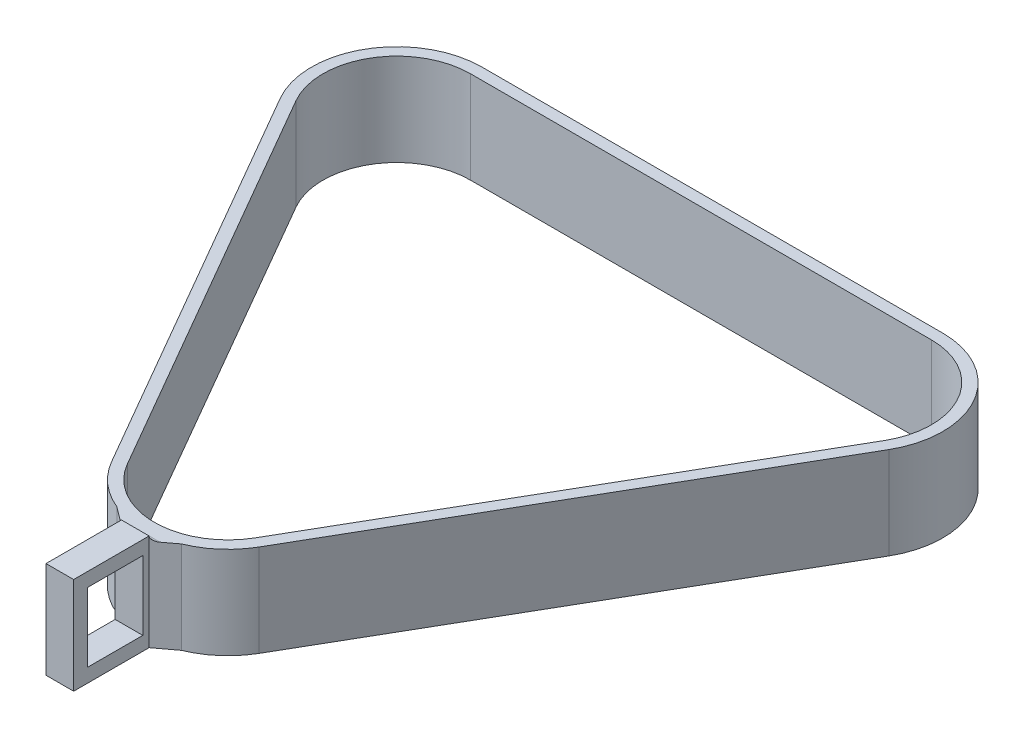
ISO-10303-21;
HEADER;
FILE_DESCRIPTION(('STEP AP214'),'2;1');
FILE_NAME('part.step','',(''),(''),'','','');
FILE_SCHEMA(('AUTOMOTIVE_DESIGN { 1 0 10303 214 1 1 1 1 }'));
ENDSEC;
DATA;
#1=APPLICATION_CONTEXT('core data for automotive mechanical design processes');
#2=APPLICATION_PROTOCOL_DEFINITION('international standard','automotive_design',2000,#1);
#3=PRODUCT_CONTEXT('',#1,'mechanical');
#4=PRODUCT('Part','Part','',(#3));
#5=PRODUCT_RELATED_PRODUCT_CATEGORY('part','',(#4));
#6=PRODUCT_DEFINITION_FORMATION('','',#4);
#7=PRODUCT_DEFINITION_CONTEXT('part definition',#1,'design');
#8=PRODUCT_DEFINITION('design','',#6,#7);
#9=PRODUCT_DEFINITION_SHAPE('','',#8);
#10=(LENGTH_UNIT() NAMED_UNIT(*) SI_UNIT(.MILLI.,.METRE.));
#11=(NAMED_UNIT(*) PLANE_ANGLE_UNIT() SI_UNIT($,.RADIAN.));
#12=(NAMED_UNIT(*) SI_UNIT($,.STERADIAN.) SOLID_ANGLE_UNIT());
#13=UNCERTAINTY_MEASURE_WITH_UNIT(LENGTH_MEASURE(1.E-05),#10,'distance_accuracy_value','');
#14=(GEOMETRIC_REPRESENTATION_CONTEXT(3) GLOBAL_UNCERTAINTY_ASSIGNED_CONTEXT((#13)) GLOBAL_UNIT_ASSIGNED_CONTEXT((#10,
#11,#12)) REPRESENTATION_CONTEXT('',''));
#15=CARTESIAN_POINT('',(0.,0.,0.));
#16=DIRECTION('',(0.,0.,1.));
#17=DIRECTION('',(1.,0.,0.));
#18=AXIS2_PLACEMENT_3D('',#15,#16,#17);
#19=CARTESIAN_POINT('',(70.3090004006341,0.,93.745333867512));
#20=DIRECTION('',(-0.600000000000001,0.,-0.799999999999999));
#21=DIRECTION('',(-0.799999999999999,0.,0.600000000000001));
#22=AXIS2_PLACEMENT_3D('',#19,#20,#21);
#23=PLANE('',#22);
#24=DIRECTION('',(0.799999999999999,0.,-0.600000000000001));
#25=VECTOR('',#24,1.);
#26=CARTESIAN_POINT('',(70.3090004006341,20.,93.745333867512));
#27=LINE('',#26,#25);
#28=CARTESIAN_POINT('',(54.3333333333333,20.,105.727084167988));
#29=VERTEX_POINT('',#28);
#30=CARTESIAN_POINT('',(57.,20.,103.727084167988));
#31=VERTEX_POINT('',#30);
#32=EDGE_CURVE('E383',#29,#31,#27,.T.);
#33=ORIENTED_EDGE('',*,*,#32,.F.);
#34=CARTESIAN_POINT('',(54.3333333333333,21.,105.727084167988));
#35=DIRECTION('',(-0.600000000000001,0.,-0.799999999999999));
#36=DIRECTION('',(-0.799999999999999,0.,0.600000000000001));
#37=AXIS2_PLACEMENT_3D('',#34,#35,#36);
#38=ELLIPSE('',#37,1.66666666666666,1.);
#39=CARTESIAN_POINT('',(53.,21.,106.727084167988));
#40=VERTEX_POINT('',#39);
#41=EDGE_CURVE('E56',#29,#40,#38,.T.);
#42=ORIENTED_EDGE('',*,*,#41,.T.);
#43=DIRECTION('',(0.,1.,0.));
#44=VECTOR('',#43,1.);
#45=CARTESIAN_POINT('',(53.,0.,106.727084167988));
#46=LINE('',#45,#44);
#47=CARTESIAN_POINT('',(53.,0.,106.727084167988));
#48=VERTEX_POINT('',#47);
#49=EDGE_CURVE('E63',#48,#40,#46,.T.);
#50=ORIENTED_EDGE('',*,*,#49,.F.);
#51=DIRECTION('',(-0.799999999999999,0.,0.600000000000001));
#52=VECTOR('',#51,1.);
#53=CARTESIAN_POINT('',(70.3090004006341,0.,93.745333867512));
#54=LINE('',#53,#52);
#55=CARTESIAN_POINT('',(57.,0.,103.727084167988));
#56=VERTEX_POINT('',#55);
#57=EDGE_CURVE('E336',#56,#48,#54,.T.);
#58=ORIENTED_EDGE('',*,*,#57,.F.);
#59=DIRECTION('',(0.,1.,0.));
#60=VECTOR('',#59,1.);
#61=CARTESIAN_POINT('',(57.,0.,103.727084167988));
#62=LINE('',#61,#60);
#63=EDGE_CURVE('E330',#56,#31,#62,.T.);
#64=ORIENTED_EDGE('',*,*,#63,.T.);
#65=EDGE_LOOP('',(#33,#42,#50,#58,#64));
#66=FACE_BOUND('',#65,.T.);
#67=ADVANCED_FACE('F47',(#66),#23,.F.);
#68=CARTESIAN_POINT('',(-34.309000400634,0.,45.7453338675119));
#69=DIRECTION('',(0.600000000000001,0.,-0.799999999999999));
#70=DIRECTION('',(-0.799999999999999,0.,-0.600000000000001));
#71=AXIS2_PLACEMENT_3D('',#68,#69,#70);
#72=PLANE('',#71);
#73=DIRECTION('',(0.799999999999999,0.,0.600000000000001));
#74=VECTOR('',#73,1.);
#75=CARTESIAN_POINT('',(-34.309000400634,20.,45.7453338675119));
#76=LINE('',#75,#74);
#77=CARTESIAN_POINT('',(43.,20.,103.727084167988));
#78=VERTEX_POINT('',#77);
#79=CARTESIAN_POINT('',(45.6666666666667,20.,105.727084167988));
#80=VERTEX_POINT('',#79);
#81=EDGE_CURVE('E198',#78,#80,#76,.T.);
#82=ORIENTED_EDGE('',*,*,#81,.F.);
#83=DIRECTION('',(0.,1.,0.));
#84=VECTOR('',#83,1.);
#85=CARTESIAN_POINT('',(43.,0.,103.727084167988));
#86=LINE('',#85,#84);
#87=CARTESIAN_POINT('',(43.,0.,103.727084167988));
#88=VERTEX_POINT('',#87);
#89=EDGE_CURVE('E210',#88,#78,#86,.T.);
#90=ORIENTED_EDGE('',*,*,#89,.F.);
#91=DIRECTION('',(-0.799999999999999,0.,-0.600000000000001));
#92=VECTOR('',#91,1.);
#93=CARTESIAN_POINT('',(-34.309000400634,0.,45.7453338675119));
#94=LINE('',#93,#92);
#95=CARTESIAN_POINT('',(47.,0.,106.727084167988));
#96=VERTEX_POINT('',#95);
#97=EDGE_CURVE('E206',#96,#88,#94,.T.);
#98=ORIENTED_EDGE('',*,*,#97,.F.);
#99=DIRECTION('',(0.,1.,0.));
#100=VECTOR('',#99,1.);
#101=CARTESIAN_POINT('',(47.,0.,106.727084167988));
#102=LINE('',#101,#100);
#103=CARTESIAN_POINT('',(47.,21.,106.727084167988));
#104=VERTEX_POINT('',#103);
#105=EDGE_CURVE('E202',#96,#104,#102,.T.);
#106=ORIENTED_EDGE('',*,*,#105,.T.);
#107=CARTESIAN_POINT('',(45.6666666666667,21.,105.727084167988));
#108=DIRECTION('',(0.600000000000001,0.,-0.799999999999999));
#109=DIRECTION('',(-0.799999999999999,0.,-0.600000000000001));
#110=AXIS2_PLACEMENT_3D('',#107,#108,#109);
#111=ELLIPSE('',#110,1.66666666666666,1.);
#112=EDGE_CURVE('E11',#104,#80,#111,.T.);
#113=ORIENTED_EDGE('',*,*,#112,.T.);
#114=EDGE_LOOP('',(#82,#90,#98,#106,#113));
#115=FACE_BOUND('',#114,.T.);
#116=ADVANCED_FACE('F204',(#115),#72,.F.);
#117=CARTESIAN_POINT('',(0.,21.,0.));
#118=DIRECTION('',(0.,1.,0.));
#119=DIRECTION('',(0.,0.,1.));
#120=AXIS2_PLACEMENT_3D('',#117,#118,#119);
#121=PLANE('',#120);
#122=DIRECTION('',(0.,0.,-1.));
#123=VECTOR('',#122,1.);
#124=CARTESIAN_POINT('',(53.,21.,105.102540378444));
#125=LINE('',#124,#123);
#126=CARTESIAN_POINT('',(53.,21.,123.102540378444));
#127=VERTEX_POINT('',#126);
#128=EDGE_CURVE('E218',#127,#40,#125,.T.);
#129=ORIENTED_EDGE('',*,*,#128,.T.);
#130=DIRECTION('',(1.,0.,0.));
#131=VECTOR('',#130,1.);
#132=CARTESIAN_POINT('',(20.,21.,106.727084167988));
#133=LINE('',#132,#131);
#134=EDGE_CURVE('E215',#104,#40,#133,.T.);
#135=ORIENTED_EDGE('',*,*,#134,.F.);
#136=DIRECTION('',(0.,0.,-1.));
#137=VECTOR('',#136,1.);
#138=CARTESIAN_POINT('',(47.,21.,105.102540378444));
#139=LINE('',#138,#137);
#140=CARTESIAN_POINT('',(47.,21.,123.102540378444));
#141=VERTEX_POINT('',#140);
#142=EDGE_CURVE('E217',#141,#104,#139,.T.);
#143=ORIENTED_EDGE('',*,*,#142,.F.);
#144=DIRECTION('',(-1.,0.,0.));
#145=VECTOR('',#144,1.);
#146=CARTESIAN_POINT('',(53.,21.,123.102540378444));
#147=LINE('',#146,#145);
#148=EDGE_CURVE('E338',#127,#141,#147,.T.);
#149=ORIENTED_EDGE('',*,*,#148,.F.);
#150=EDGE_LOOP('',(#129,#135,#143,#149));
#151=FACE_BOUND('',#150,.T.);
#152=ADVANCED_FACE('F216',(#151),#121,.T.);
#153=CARTESIAN_POINT('',(50.,20.,86.6025403784439));
#154=DIRECTION('',(0.,-1.,0.));
#155=DIRECTION('',(0.,0.,-1.));
#156=AXIS2_PLACEMENT_3D('',#153,#154,#155);
#157=CYLINDRICAL_SURFACE('',#156,18.5);
#158=ORIENTED_EDGE('',*,*,#89,.T.);
#159=CARTESIAN_POINT('',(50.,20.,86.6025403784439));
#160=DIRECTION('',(0.,1.,0.));
#161=DIRECTION('',(0.,0.,1.));
#162=AXIS2_PLACEMENT_3D('',#159,#160,#161);
#163=CIRCLE('',#162,18.5);
#164=CARTESIAN_POINT('',(33.9785300299879,20.,95.8525403784439));
#165=VERTEX_POINT('',#164);
#166=EDGE_CURVE('E316',#165,#78,#163,.T.);
#167=ORIENTED_EDGE('',*,*,#166,.F.);
#168=DIRECTION('',(0.,-1.,0.));
#169=VECTOR('',#168,1.);
#170=CARTESIAN_POINT('',(33.9785300299879,20.,95.8525403784439));
#171=LINE('',#170,#169);
#172=CARTESIAN_POINT('',(33.9785300299879,0.,95.8525403784439));
#173=VERTEX_POINT('',#172);
#174=EDGE_CURVE('E251',#165,#173,#171,.T.);
#175=ORIENTED_EDGE('',*,*,#174,.T.);
#176=CARTESIAN_POINT('',(50.,0.,86.6025403784439));
#177=DIRECTION('',(0.,1.,0.));
#178=DIRECTION('',(0.,0.,1.));
#179=AXIS2_PLACEMENT_3D('',#176,#177,#178);
#180=CIRCLE('',#179,18.5);
#181=EDGE_CURVE('E285',#173,#88,#180,.T.);
#182=ORIENTED_EDGE('',*,*,#181,.T.);
#183=EDGE_LOOP('',(#158,#167,#175,#182));
#184=FACE_BOUND('',#183,.T.);
#185=ADVANCED_FACE('F390',(#184),#157,.T.);
#186=ORIENTED_EDGE('',*,*,#63,.F.);
#187=CARTESIAN_POINT('',(66.0214699700121,0.,95.8525403784439));
#188=VERTEX_POINT('',#187);
#189=EDGE_CURVE('E288',#56,#188,#180,.T.);
#190=ORIENTED_EDGE('',*,*,#189,.T.);
#191=DIRECTION('',(0.,-1.,0.));
#192=VECTOR('',#191,1.);
#193=CARTESIAN_POINT('',(66.0214699700121,20.,95.8525403784439));
#194=LINE('',#193,#192);
#195=CARTESIAN_POINT('',(66.0214699700121,20.,95.8525403784439));
#196=VERTEX_POINT('',#195);
#197=EDGE_CURVE('E254',#196,#188,#194,.T.);
#198=ORIENTED_EDGE('',*,*,#197,.F.);
#199=EDGE_CURVE('E319',#31,#196,#163,.T.);
#200=ORIENTED_EDGE('',*,*,#199,.F.);
#201=EDGE_LOOP('',(#186,#190,#198,#200));
#202=FACE_BOUND('',#201,.T.);
#203=ADVANCED_FACE('F428',(#202),#157,.T.);
#204=CARTESIAN_POINT('',(0.,20.,0.));
#205=DIRECTION('',(0.,1.,0.));
#206=DIRECTION('',(0.,0.,1.));
#207=AXIS2_PLACEMENT_3D('',#204,#205,#206);
#208=PLANE('',#207);
#209=CARTESIAN_POINT('',(100.,20.,0.));
#210=DIRECTION('',(0.,1.,0.));
#211=DIRECTION('',(0.,0.,1.));
#212=AXIS2_PLACEMENT_3D('',#209,#210,#211);
#213=CIRCLE('',#212,16.);
#214=CARTESIAN_POINT('',(113.856406460551,20.,8.));
#215=VERTEX_POINT('',#214);
#216=CARTESIAN_POINT('',(100.,20.,-16.));
#217=VERTEX_POINT('',#216);
#218=EDGE_CURVE('E313',#215,#217,#213,.T.);
#219=ORIENTED_EDGE('',*,*,#218,.F.);
#220=DIRECTION('',(-0.5,0.,0.866025403784439));
#221=VECTOR('',#220,1.);
#222=CARTESIAN_POINT('',(88.856406460551,20.,51.3012701892219));
#223=LINE('',#222,#221);
#224=CARTESIAN_POINT('',(63.856406460551,20.,94.6025403784439));
#225=VERTEX_POINT('',#224);
#226=EDGE_CURVE('E311',#215,#225,#223,.T.);
#227=ORIENTED_EDGE('',*,*,#226,.T.);
#228=CARTESIAN_POINT('',(50.,20.,86.6025403784439));
#229=DIRECTION('',(0.,1.,0.));
#230=DIRECTION('',(0.,0.,1.));
#231=AXIS2_PLACEMENT_3D('',#228,#229,#230);
#232=CIRCLE('',#231,16.);
#233=CARTESIAN_POINT('',(36.143593539449,20.,94.6025403784439));
#234=VERTEX_POINT('',#233);
#235=EDGE_CURVE('E308',#234,#225,#232,.T.);
#236=ORIENTED_EDGE('',*,*,#235,.F.);
#237=DIRECTION('',(0.5,0.,0.866025403784439));
#238=VECTOR('',#237,1.);
#239=CARTESIAN_POINT('',(-13.856406460551,20.,8.));
#240=LINE('',#239,#238);
#241=CARTESIAN_POINT('',(-13.856406460551,20.,8.));
#242=VERTEX_POINT('',#241);
#243=EDGE_CURVE('E305',#242,#234,#240,.T.);
#244=ORIENTED_EDGE('',*,*,#243,.F.);
#245=CARTESIAN_POINT('',(0.,20.,0.));
#246=DIRECTION('',(0.,1.,0.));
#247=DIRECTION('',(0.,0.,1.));
#248=AXIS2_PLACEMENT_3D('',#245,#246,#247);
#249=CIRCLE('',#248,16.);
#250=CARTESIAN_POINT('',(0.,20.,-16.));
#251=VERTEX_POINT('',#250);
#252=EDGE_CURVE('E302',#251,#242,#249,.T.);
#253=ORIENTED_EDGE('',*,*,#252,.F.);
#254=DIRECTION('',(-1.,0.,0.));
#255=VECTOR('',#254,1.);
#256=CARTESIAN_POINT('',(0.,20.,-16.));
#257=LINE('',#256,#255);
#258=EDGE_CURVE('E256',#217,#251,#257,.T.);
#259=ORIENTED_EDGE('',*,*,#258,.F.);
#260=EDGE_LOOP('',(#219,#227,#236,#244,#253,#259));
#261=FACE_BOUND('',#260,.T.);
#262=ORIENTED_EDGE('',*,*,#81,.T.);
#263=DIRECTION('',(1.,0.,0.));
#264=VECTOR('',#263,1.);
#265=CARTESIAN_POINT('',(53.,20.,105.727084167988));
#266=LINE('',#265,#264);
#267=EDGE_CURVE('E230',#80,#29,#266,.T.);
#268=ORIENTED_EDGE('',*,*,#267,.T.);
#269=ORIENTED_EDGE('',*,*,#32,.T.);
#270=ORIENTED_EDGE('',*,*,#199,.T.);
#271=DIRECTION('',(0.5,0.,-0.866025403784439));
#272=VECTOR('',#271,1.);
#273=CARTESIAN_POINT('',(91.0214699700121,20.,52.5512701892219));
#274=LINE('',#273,#272);
#275=CARTESIAN_POINT('',(116.021469970012,20.,9.25000000000001));
#276=VERTEX_POINT('',#275);
#277=EDGE_CURVE('E269',#196,#276,#274,.T.);
#278=ORIENTED_EDGE('',*,*,#277,.T.);
#279=CARTESIAN_POINT('',(100.,20.,0.));
#280=DIRECTION('',(0.,1.,0.));
#281=DIRECTION('',(0.,0.,1.));
#282=AXIS2_PLACEMENT_3D('',#279,#280,#281);
#283=CIRCLE('',#282,18.5);
#284=CARTESIAN_POINT('',(100.,20.,-18.5));
#285=VERTEX_POINT('',#284);
#286=EDGE_CURVE('E326',#276,#285,#283,.T.);
#287=ORIENTED_EDGE('',*,*,#286,.T.);
#288=DIRECTION('',(-1.,0.,0.));
#289=VECTOR('',#288,1.);
#290=CARTESIAN_POINT('',(0.,20.,-18.5));
#291=LINE('',#290,#289);
#292=CARTESIAN_POINT('',(0.,20.,-18.5));
#293=VERTEX_POINT('',#292);
#294=EDGE_CURVE('E324',#285,#293,#291,.T.);
#295=ORIENTED_EDGE('',*,*,#294,.T.);
#296=CARTESIAN_POINT('',(0.,20.,0.));
#297=DIRECTION('',(0.,1.,0.));
#298=DIRECTION('',(0.,0.,1.));
#299=AXIS2_PLACEMENT_3D('',#296,#297,#298);
#300=CIRCLE('',#299,18.5);
#301=CARTESIAN_POINT('',(-16.0214699700121,20.,9.25));
#302=VERTEX_POINT('',#301);
#303=EDGE_CURVE('E322',#293,#302,#300,.T.);
#304=ORIENTED_EDGE('',*,*,#303,.T.);
#305=DIRECTION('',(0.5,0.,0.866025403784439));
#306=VECTOR('',#305,1.);
#307=CARTESIAN_POINT('',(-16.0214699700121,20.,9.25));
#308=LINE('',#307,#306);
#309=EDGE_CURVE('E320',#302,#165,#308,.T.);
#310=ORIENTED_EDGE('',*,*,#309,.T.);
#311=ORIENTED_EDGE('',*,*,#166,.T.);
#312=EDGE_LOOP('',(#262,#268,#269,#270,#278,#287,#295,#304,#310,#311));
#313=FACE_BOUND('',#312,.T.);
#314=ADVANCED_FACE('F385',(#261,#313),#208,.T.);
#315=CARTESIAN_POINT('',(100.,20.,0.));
#316=DIRECTION('',(0.,-1.,0.));
#317=DIRECTION('',(0.,0.,-1.));
#318=AXIS2_PLACEMENT_3D('',#315,#316,#317);
#319=CYLINDRICAL_SURFACE('',#318,16.);
#320=CARTESIAN_POINT('',(100.,0.,0.));
#321=DIRECTION('',(0.,1.,0.));
#322=DIRECTION('',(0.,0.,1.));
#323=AXIS2_PLACEMENT_3D('',#320,#321,#322);
#324=CIRCLE('',#323,16.);
#325=CARTESIAN_POINT('',(113.856406460551,0.,8.));
#326=VERTEX_POINT('',#325);
#327=CARTESIAN_POINT('',(100.,0.,-16.));
#328=VERTEX_POINT('',#327);
#329=EDGE_CURVE('E282',#326,#328,#324,.T.);
#330=ORIENTED_EDGE('',*,*,#329,.F.);
#331=DIRECTION('',(0.,-1.,0.));
#332=VECTOR('',#331,1.);
#333=CARTESIAN_POINT('',(113.856406460551,20.,8.));
#334=LINE('',#333,#332);
#335=EDGE_CURVE('E233',#215,#326,#334,.T.);
#336=ORIENTED_EDGE('',*,*,#335,.F.);
#337=ORIENTED_EDGE('',*,*,#218,.T.);
#338=DIRECTION('',(0.,-1.,0.));
#339=VECTOR('',#338,1.);
#340=CARTESIAN_POINT('',(100.,20.,-16.));
#341=LINE('',#340,#339);
#342=EDGE_CURVE('E241',#217,#328,#341,.T.);
#343=ORIENTED_EDGE('',*,*,#342,.T.);
#344=EDGE_LOOP('',(#330,#336,#337,#343));
#345=FACE_BOUND('',#344,.T.);
#346=ADVANCED_FACE('F427',(#345),#319,.F.);
#347=CARTESIAN_POINT('',(88.856406460551,20.,51.3012701892219));
#348=DIRECTION('',(0.866025403784439,0.,0.5));
#349=DIRECTION('',(0.5,0.,-0.866025403784439));
#350=AXIS2_PLACEMENT_3D('',#347,#348,#349);
#351=PLANE('',#350);
#352=DIRECTION('',(-0.5,0.,0.866025403784439));
#353=VECTOR('',#352,1.);
#354=CARTESIAN_POINT('',(88.856406460551,0.,51.3012701892219));
#355=LINE('',#354,#353);
#356=CARTESIAN_POINT('',(63.856406460551,0.,94.6025403784439));
#357=VERTEX_POINT('',#356);
#358=EDGE_CURVE('E279',#326,#357,#355,.T.);
#359=ORIENTED_EDGE('',*,*,#358,.T.);
#360=DIRECTION('',(0.,-1.,0.));
#361=VECTOR('',#360,1.);
#362=CARTESIAN_POINT('',(63.856406460551,20.,94.6025403784439));
#363=LINE('',#362,#361);
#364=EDGE_CURVE('E235',#225,#357,#363,.T.);
#365=ORIENTED_EDGE('',*,*,#364,.F.);
#366=ORIENTED_EDGE('',*,*,#226,.F.);
#367=ORIENTED_EDGE('',*,*,#335,.T.);
#368=EDGE_LOOP('',(#359,#365,#366,#367));
#369=FACE_BOUND('',#368,.T.);
#370=ADVANCED_FACE('F447',(#369),#351,.F.);
#371=CARTESIAN_POINT('',(50.,20.,86.6025403784439));
#372=DIRECTION('',(0.,-1.,0.));
#373=DIRECTION('',(0.,0.,-1.));
#374=AXIS2_PLACEMENT_3D('',#371,#372,#373);
#375=CYLINDRICAL_SURFACE('',#374,16.);
#376=CARTESIAN_POINT('',(50.,0.,86.6025403784439));
#377=DIRECTION('',(0.,1.,0.));
#378=DIRECTION('',(0.,0.,1.));
#379=AXIS2_PLACEMENT_3D('',#376,#377,#378);
#380=CIRCLE('',#379,16.);
#381=CARTESIAN_POINT('',(36.143593539449,0.,94.6025403784439));
#382=VERTEX_POINT('',#381);
#383=EDGE_CURVE('E276',#382,#357,#380,.T.);
#384=ORIENTED_EDGE('',*,*,#383,.F.);
#385=DIRECTION('',(0.,-1.,0.));
#386=VECTOR('',#385,1.);
#387=CARTESIAN_POINT('',(36.143593539449,20.,94.6025403784439));
#388=LINE('',#387,#386);
#389=EDGE_CURVE('E259',#234,#382,#388,.T.);
#390=ORIENTED_EDGE('',*,*,#389,.F.);
#391=ORIENTED_EDGE('',*,*,#235,.T.);
#392=ORIENTED_EDGE('',*,*,#364,.T.);
#393=EDGE_LOOP('',(#384,#390,#391,#392));
#394=FACE_BOUND('',#393,.T.);
#395=ADVANCED_FACE('F443',(#394),#375,.F.);
#396=CARTESIAN_POINT('',(-13.856406460551,20.,8.));
#397=DIRECTION('',(0.866025403784439,0.,-0.5));
#398=DIRECTION('',(-0.5,0.,-0.866025403784439));
#399=AXIS2_PLACEMENT_3D('',#396,#397,#398);
#400=PLANE('',#399);
#401=DIRECTION('',(0.5,0.,0.866025403784439));
#402=VECTOR('',#401,1.);
#403=CARTESIAN_POINT('',(-13.856406460551,0.,8.));
#404=LINE('',#403,#402);
#405=CARTESIAN_POINT('',(-13.856406460551,0.,8.));
#406=VERTEX_POINT('',#405);
#407=EDGE_CURVE('E273',#406,#382,#404,.T.);
#408=ORIENTED_EDGE('',*,*,#407,.F.);
#409=DIRECTION('',(0.,-1.,0.));
#410=VECTOR('',#409,1.);
#411=CARTESIAN_POINT('',(-13.856406460551,20.,8.));
#412=LINE('',#411,#410);
#413=EDGE_CURVE('E261',#242,#406,#412,.T.);
#414=ORIENTED_EDGE('',*,*,#413,.F.);
#415=ORIENTED_EDGE('',*,*,#243,.T.);
#416=ORIENTED_EDGE('',*,*,#389,.T.);
#417=EDGE_LOOP('',(#408,#414,#415,#416));
#418=FACE_BOUND('',#417,.T.);
#419=ADVANCED_FACE('F439',(#418),#400,.T.);
#420=CARTESIAN_POINT('',(0.,20.,0.));
#421=DIRECTION('',(0.,-1.,0.));
#422=DIRECTION('',(0.,0.,-1.));
#423=AXIS2_PLACEMENT_3D('',#420,#421,#422);
#424=CYLINDRICAL_SURFACE('',#423,16.);
#425=CARTESIAN_POINT('',(0.,0.,0.));
#426=DIRECTION('',(0.,1.,0.));
#427=DIRECTION('',(0.,0.,1.));
#428=AXIS2_PLACEMENT_3D('',#425,#426,#427);
#429=CIRCLE('',#428,16.);
#430=CARTESIAN_POINT('',(0.,0.,-16.));
#431=VERTEX_POINT('',#430);
#432=EDGE_CURVE('E270',#431,#406,#429,.T.);
#433=ORIENTED_EDGE('',*,*,#432,.F.);
#434=DIRECTION('',(0.,-1.,0.));
#435=VECTOR('',#434,1.);
#436=CARTESIAN_POINT('',(0.,20.,-16.));
#437=LINE('',#436,#435);
#438=EDGE_CURVE('E263',#251,#431,#437,.T.);
#439=ORIENTED_EDGE('',*,*,#438,.F.);
#440=ORIENTED_EDGE('',*,*,#252,.T.);
#441=ORIENTED_EDGE('',*,*,#413,.T.);
#442=EDGE_LOOP('',(#433,#439,#440,#441));
#443=FACE_BOUND('',#442,.T.);
#444=ADVANCED_FACE('F435',(#443),#424,.F.);
#445=CARTESIAN_POINT('',(91.0214699700121,20.,52.5512701892219));
#446=DIRECTION('',(-0.866025403784439,0.,-0.5));
#447=DIRECTION('',(-0.5,0.,0.866025403784439));
#448=AXIS2_PLACEMENT_3D('',#445,#446,#447);
#449=PLANE('',#448);
#450=DIRECTION('',(0.5,0.,-0.866025403784439));
#451=VECTOR('',#450,1.);
#452=CARTESIAN_POINT('',(91.0214699700121,0.,52.5512701892219));
#453=LINE('',#452,#451);
#454=CARTESIAN_POINT('',(116.021469970012,0.,9.25000000000001));
#455=VERTEX_POINT('',#454);
#456=EDGE_CURVE('E297',#188,#455,#453,.T.);
#457=ORIENTED_EDGE('',*,*,#456,.T.);
#458=DIRECTION('',(0.,-1.,0.));
#459=VECTOR('',#458,1.);
#460=CARTESIAN_POINT('',(116.021469970012,20.,9.25000000000001));
#461=LINE('',#460,#459);
#462=EDGE_CURVE('E238',#276,#455,#461,.T.);
#463=ORIENTED_EDGE('',*,*,#462,.F.);
#464=ORIENTED_EDGE('',*,*,#277,.F.);
#465=ORIENTED_EDGE('',*,*,#197,.T.);
#466=EDGE_LOOP('',(#457,#463,#464,#465));
#467=FACE_BOUND('',#466,.T.);
#468=ADVANCED_FACE('F438',(#467),#449,.F.);
#469=CARTESIAN_POINT('',(100.,20.,0.));
#470=DIRECTION('',(0.,-1.,0.));
#471=DIRECTION('',(0.,0.,-1.));
#472=AXIS2_PLACEMENT_3D('',#469,#470,#471);
#473=CYLINDRICAL_SURFACE('',#472,18.5);
#474=CARTESIAN_POINT('',(100.,0.,0.));
#475=DIRECTION('',(0.,1.,0.));
#476=DIRECTION('',(0.,0.,1.));
#477=AXIS2_PLACEMENT_3D('',#474,#475,#476);
#478=CIRCLE('',#477,18.5);
#479=CARTESIAN_POINT('',(100.,0.,-18.5));
#480=VERTEX_POINT('',#479);
#481=EDGE_CURVE('E295',#455,#480,#478,.T.);
#482=ORIENTED_EDGE('',*,*,#481,.T.);
#483=DIRECTION('',(0.,-1.,0.));
#484=VECTOR('',#483,1.);
#485=CARTESIAN_POINT('',(100.,20.,-18.5));
#486=LINE('',#485,#484);
#487=EDGE_CURVE('E242',#285,#480,#486,.T.);
#488=ORIENTED_EDGE('',*,*,#487,.F.);
#489=ORIENTED_EDGE('',*,*,#286,.F.);
#490=ORIENTED_EDGE('',*,*,#462,.T.);
#491=EDGE_LOOP('',(#482,#488,#489,#490));
#492=FACE_BOUND('',#491,.T.);
#493=ADVANCED_FACE('F467',(#492),#473,.T.);
#494=CARTESIAN_POINT('',(0.,20.,-18.5));
#495=DIRECTION('',(0.,0.,1.));
#496=DIRECTION('',(1.,0.,0.));
#497=AXIS2_PLACEMENT_3D('',#494,#495,#496);
#498=PLANE('',#497);
#499=DIRECTION('',(-1.,0.,0.));
#500=VECTOR('',#499,1.);
#501=CARTESIAN_POINT('',(0.,0.,-18.5));
#502=LINE('',#501,#500);
#503=CARTESIAN_POINT('',(0.,0.,-18.5));
#504=VERTEX_POINT('',#503);
#505=EDGE_CURVE('E293',#480,#504,#502,.T.);
#506=ORIENTED_EDGE('',*,*,#505,.T.);
#507=DIRECTION('',(0.,-1.,0.));
#508=VECTOR('',#507,1.);
#509=CARTESIAN_POINT('',(0.,20.,-18.5));
#510=LINE('',#509,#508);
#511=EDGE_CURVE('E245',#293,#504,#510,.T.);
#512=ORIENTED_EDGE('',*,*,#511,.F.);
#513=ORIENTED_EDGE('',*,*,#294,.F.);
#514=ORIENTED_EDGE('',*,*,#487,.T.);
#515=EDGE_LOOP('',(#506,#512,#513,#514));
#516=FACE_BOUND('',#515,.T.);
#517=ADVANCED_FACE('F463',(#516),#498,.F.);
#518=CARTESIAN_POINT('',(0.,20.,0.));
#519=DIRECTION('',(0.,-1.,0.));
#520=DIRECTION('',(0.,0.,-1.));
#521=AXIS2_PLACEMENT_3D('',#518,#519,#520);
#522=CYLINDRICAL_SURFACE('',#521,18.5);
#523=CARTESIAN_POINT('',(0.,0.,0.));
#524=DIRECTION('',(0.,1.,0.));
#525=DIRECTION('',(0.,0.,1.));
#526=AXIS2_PLACEMENT_3D('',#523,#524,#525);
#527=CIRCLE('',#526,18.5);
#528=CARTESIAN_POINT('',(-16.0214699700121,0.,9.25));
#529=VERTEX_POINT('',#528);
#530=EDGE_CURVE('E291',#504,#529,#527,.T.);
#531=ORIENTED_EDGE('',*,*,#530,.T.);
#532=DIRECTION('',(0.,-1.,0.));
#533=VECTOR('',#532,1.);
#534=CARTESIAN_POINT('',(-16.0214699700121,20.,9.25));
#535=LINE('',#534,#533);
#536=EDGE_CURVE('E248',#302,#529,#535,.T.);
#537=ORIENTED_EDGE('',*,*,#536,.F.);
#538=ORIENTED_EDGE('',*,*,#303,.F.);
#539=ORIENTED_EDGE('',*,*,#511,.T.);
#540=EDGE_LOOP('',(#531,#537,#538,#539));
#541=FACE_BOUND('',#540,.T.);
#542=ADVANCED_FACE('F459',(#541),#522,.T.);
#543=CARTESIAN_POINT('',(-16.0214699700121,20.,9.25));
#544=DIRECTION('',(0.866025403784439,0.,-0.5));
#545=DIRECTION('',(-0.5,0.,-0.866025403784439));
#546=AXIS2_PLACEMENT_3D('',#543,#544,#545);
#547=PLANE('',#546);
#548=DIRECTION('',(0.5,0.,0.866025403784439));
#549=VECTOR('',#548,1.);
#550=CARTESIAN_POINT('',(-16.0214699700121,0.,9.25));
#551=LINE('',#550,#549);
#552=EDGE_CURVE('E289',#529,#173,#551,.T.);
#553=ORIENTED_EDGE('',*,*,#552,.T.);
#554=ORIENTED_EDGE('',*,*,#174,.F.);
#555=ORIENTED_EDGE('',*,*,#309,.F.);
#556=ORIENTED_EDGE('',*,*,#536,.T.);
#557=EDGE_LOOP('',(#553,#554,#555,#556));
#558=FACE_BOUND('',#557,.T.);
#559=ADVANCED_FACE('F433',(#558),#547,.F.);
#560=CARTESIAN_POINT('',(0.,20.,-16.));
#561=DIRECTION('',(0.,0.,1.));
#562=DIRECTION('',(1.,0.,0.));
#563=AXIS2_PLACEMENT_3D('',#560,#561,#562);
#564=PLANE('',#563);
#565=DIRECTION('',(-1.,0.,0.));
#566=VECTOR('',#565,1.);
#567=CARTESIAN_POINT('',(0.,0.,-16.));
#568=LINE('',#567,#566);
#569=EDGE_CURVE('E266',#328,#431,#568,.T.);
#570=ORIENTED_EDGE('',*,*,#569,.F.);
#571=ORIENTED_EDGE('',*,*,#342,.F.);
#572=ORIENTED_EDGE('',*,*,#258,.T.);
#573=ORIENTED_EDGE('',*,*,#438,.T.);
#574=EDGE_LOOP('',(#570,#571,#572,#573));
#575=FACE_BOUND('',#574,.T.);
#576=ADVANCED_FACE('F413',(#575),#564,.T.);
#577=CARTESIAN_POINT('',(0.,0.,0.));
#578=DIRECTION('',(0.,1.,0.));
#579=DIRECTION('',(0.,0.,1.));
#580=AXIS2_PLACEMENT_3D('',#577,#578,#579);
#581=PLANE('',#580);
#582=ORIENTED_EDGE('',*,*,#189,.F.);
#583=ORIENTED_EDGE('',*,*,#57,.T.);
#584=DIRECTION('',(0.,0.,1.));
#585=VECTOR('',#584,1.);
#586=CARTESIAN_POINT('',(53.,0.,105.102540378444));
#587=LINE('',#586,#585);
#588=CARTESIAN_POINT('',(53.,0.,123.102540378444));
#589=VERTEX_POINT('',#588);
#590=EDGE_CURVE('E347',#48,#589,#587,.T.);
#591=ORIENTED_EDGE('',*,*,#590,.T.);
#592=DIRECTION('',(-1.,0.,0.));
#593=VECTOR('',#592,1.);
#594=CARTESIAN_POINT('',(53.,0.,123.102540378444));
#595=LINE('',#594,#593);
#596=CARTESIAN_POINT('',(47.,0.,123.102540378444));
#597=VERTEX_POINT('',#596);
#598=EDGE_CURVE('E339',#589,#597,#595,.T.);
#599=ORIENTED_EDGE('',*,*,#598,.T.);
#600=DIRECTION('',(0.,0.,1.));
#601=VECTOR('',#600,1.);
#602=CARTESIAN_POINT('',(47.,0.,105.102540378444));
#603=LINE('',#602,#601);
#604=EDGE_CURVE('E369',#96,#597,#603,.T.);
#605=ORIENTED_EDGE('',*,*,#604,.F.);
#606=ORIENTED_EDGE('',*,*,#97,.T.);
#607=ORIENTED_EDGE('',*,*,#181,.F.);
#608=ORIENTED_EDGE('',*,*,#552,.F.);
#609=ORIENTED_EDGE('',*,*,#530,.F.);
#610=ORIENTED_EDGE('',*,*,#505,.F.);
#611=ORIENTED_EDGE('',*,*,#481,.F.);
#612=ORIENTED_EDGE('',*,*,#456,.F.);
#613=EDGE_LOOP('',(#582,#583,#591,#599,#605,#606,#607,#608,#609,#610,#611,#612));
#614=FACE_BOUND('',#613,.T.);
#615=ORIENTED_EDGE('',*,*,#329,.T.);
#616=ORIENTED_EDGE('',*,*,#569,.T.);
#617=ORIENTED_EDGE('',*,*,#432,.T.);
#618=ORIENTED_EDGE('',*,*,#407,.T.);
#619=ORIENTED_EDGE('',*,*,#383,.T.);
#620=ORIENTED_EDGE('',*,*,#358,.F.);
#621=EDGE_LOOP('',(#615,#616,#617,#618,#619,#620));
#622=FACE_BOUND('',#621,.T.);
#623=ADVANCED_FACE('F395',(#614,#622),#581,.F.);
#624=CARTESIAN_POINT('',(53.,0.,0.));
#625=DIRECTION('',(1.,0.,0.));
#626=DIRECTION('',(0.,0.,-1.));
#627=AXIS2_PLACEMENT_3D('',#624,#625,#626);
#628=PLANE('',#627);
#629=DIRECTION('',(0.,-1.,0.));
#630=VECTOR('',#629,1.);
#631=CARTESIAN_POINT('',(53.,3.,108.102540378444));
#632=LINE('',#631,#630);
#633=CARTESIAN_POINT('',(53.,18.,108.102540378444));
#634=VERTEX_POINT('',#633);
#635=CARTESIAN_POINT('',(53.,3.,108.102540378444));
#636=VERTEX_POINT('',#635);
#637=EDGE_CURVE('E226',#634,#636,#632,.T.);
#638=ORIENTED_EDGE('',*,*,#637,.T.);
#639=DIRECTION('',(0.,0.,1.));
#640=VECTOR('',#639,1.);
#641=CARTESIAN_POINT('',(53.,3.,108.102540378444));
#642=LINE('',#641,#640);
#643=CARTESIAN_POINT('',(53.,3.,120.102540378444));
#644=VERTEX_POINT('',#643);
#645=EDGE_CURVE('E363',#636,#644,#642,.T.);
#646=ORIENTED_EDGE('',*,*,#645,.T.);
#647=DIRECTION('',(0.,1.,0.));
#648=VECTOR('',#647,1.);
#649=CARTESIAN_POINT('',(53.,3.,120.102540378444));
#650=LINE('',#649,#648);
#651=CARTESIAN_POINT('',(53.,18.,120.102540378444));
#652=VERTEX_POINT('',#651);
#653=EDGE_CURVE('E360',#644,#652,#650,.T.);
#654=ORIENTED_EDGE('',*,*,#653,.T.);
#655=DIRECTION('',(0.,0.,-1.));
#656=VECTOR('',#655,1.);
#657=CARTESIAN_POINT('',(53.,18.,108.102540378444));
#658=LINE('',#657,#656);
#659=EDGE_CURVE('E353',#652,#634,#658,.T.);
#660=ORIENTED_EDGE('',*,*,#659,.T.);
#661=EDGE_LOOP('',(#638,#646,#654,#660));
#662=FACE_BOUND('',#661,.T.);
#663=ORIENTED_EDGE('',*,*,#49,.T.);
#664=ORIENTED_EDGE('',*,*,#128,.F.);
#665=DIRECTION('',(0.,1.,0.));
#666=VECTOR('',#665,1.);
#667=CARTESIAN_POINT('',(53.,0.,123.102540378444));
#668=LINE('',#667,#666);
#669=EDGE_CURVE('E344',#589,#127,#668,.T.);
#670=ORIENTED_EDGE('',*,*,#669,.F.);
#671=ORIENTED_EDGE('',*,*,#590,.F.);
#672=EDGE_LOOP('',(#663,#664,#670,#671));
#673=FACE_BOUND('',#672,.T.);
#674=ADVANCED_FACE('F402',(#662,#673),#628,.T.);
#675=CARTESIAN_POINT('',(47.,0.,0.));
#676=DIRECTION('',(1.,0.,0.));
#677=DIRECTION('',(0.,0.,-1.));
#678=AXIS2_PLACEMENT_3D('',#675,#676,#677);
#679=PLANE('',#678);
#680=DIRECTION('',(0.,-1.,0.));
#681=VECTOR('',#680,1.);
#682=CARTESIAN_POINT('',(47.,3.,108.102540378444));
#683=LINE('',#682,#681);
#684=CARTESIAN_POINT('',(47.,18.,108.102540378444));
#685=VERTEX_POINT('',#684);
#686=CARTESIAN_POINT('',(47.,3.,108.102540378444));
#687=VERTEX_POINT('',#686);
#688=EDGE_CURVE('E380',#685,#687,#683,.T.);
#689=ORIENTED_EDGE('',*,*,#688,.F.);
#690=DIRECTION('',(0.,0.,-1.));
#691=VECTOR('',#690,1.);
#692=CARTESIAN_POINT('',(47.,18.,108.102540378444));
#693=LINE('',#692,#691);
#694=CARTESIAN_POINT('',(47.,18.,120.102540378444));
#695=VERTEX_POINT('',#694);
#696=EDGE_CURVE('E371',#695,#685,#693,.T.);
#697=ORIENTED_EDGE('',*,*,#696,.F.);
#698=DIRECTION('',(0.,1.,0.));
#699=VECTOR('',#698,1.);
#700=CARTESIAN_POINT('',(47.,3.,120.102540378444));
#701=LINE('',#700,#699);
#702=CARTESIAN_POINT('',(47.,3.,120.102540378444));
#703=VERTEX_POINT('',#702);
#704=EDGE_CURVE('E374',#703,#695,#701,.T.);
#705=ORIENTED_EDGE('',*,*,#704,.F.);
#706=DIRECTION('',(0.,0.,1.));
#707=VECTOR('',#706,1.);
#708=CARTESIAN_POINT('',(47.,3.,108.102540378444));
#709=LINE('',#708,#707);
#710=EDGE_CURVE('E377',#687,#703,#709,.T.);
#711=ORIENTED_EDGE('',*,*,#710,.F.);
#712=EDGE_LOOP('',(#689,#697,#705,#711));
#713=FACE_BOUND('',#712,.T.);
#714=ORIENTED_EDGE('',*,*,#142,.T.);
#715=ORIENTED_EDGE('',*,*,#105,.F.);
#716=ORIENTED_EDGE('',*,*,#604,.T.);
#717=DIRECTION('',(0.,1.,0.));
#718=VECTOR('',#717,1.);
#719=CARTESIAN_POINT('',(47.,0.,123.102540378444));
#720=LINE('',#719,#718);
#721=EDGE_CURVE('E225',#597,#141,#720,.T.);
#722=ORIENTED_EDGE('',*,*,#721,.T.);
#723=EDGE_LOOP('',(#714,#715,#716,#722));
#724=FACE_BOUND('',#723,.T.);
#725=ADVANCED_FACE('F223',(#713,#724),#679,.F.);
#726=CARTESIAN_POINT('',(53.,0.,123.102540378444));
#727=DIRECTION('',(0.,0.,1.));
#728=DIRECTION('',(1.,0.,0.));
#729=AXIS2_PLACEMENT_3D('',#726,#727,#728);
#730=PLANE('',#729);
#731=ORIENTED_EDGE('',*,*,#148,.T.);
#732=ORIENTED_EDGE('',*,*,#721,.F.);
#733=ORIENTED_EDGE('',*,*,#598,.F.);
#734=ORIENTED_EDGE('',*,*,#669,.T.);
#735=EDGE_LOOP('',(#731,#732,#733,#734));
#736=FACE_BOUND('',#735,.T.);
#737=ADVANCED_FACE('F401',(#736),#730,.T.);
#738=CARTESIAN_POINT('',(53.,3.,108.102540378444));
#739=DIRECTION('',(0.,0.,-1.));
#740=DIRECTION('',(-1.,0.,0.));
#741=AXIS2_PLACEMENT_3D('',#738,#739,#740);
#742=PLANE('',#741);
#743=DIRECTION('',(-1.,0.,0.));
#744=VECTOR('',#743,1.);
#745=CARTESIAN_POINT('',(53.,18.,108.102540378444));
#746=LINE('',#745,#744);
#747=EDGE_CURVE('E349',#634,#685,#746,.T.);
#748=ORIENTED_EDGE('',*,*,#747,.T.);
#749=ORIENTED_EDGE('',*,*,#688,.T.);
#750=DIRECTION('',(-1.,0.,0.));
#751=VECTOR('',#750,1.);
#752=CARTESIAN_POINT('',(53.,3.,108.102540378444));
#753=LINE('',#752,#751);
#754=EDGE_CURVE('E350',#636,#687,#753,.T.);
#755=ORIENTED_EDGE('',*,*,#754,.F.);
#756=ORIENTED_EDGE('',*,*,#637,.F.);
#757=EDGE_LOOP('',(#748,#749,#755,#756));
#758=FACE_BOUND('',#757,.T.);
#759=ADVANCED_FACE('F517',(#758),#742,.F.);
#760=CARTESIAN_POINT('',(53.,18.,108.102540378444));
#761=DIRECTION('',(0.,1.,0.));
#762=DIRECTION('',(0.,0.,1.));
#763=AXIS2_PLACEMENT_3D('',#760,#761,#762);
#764=PLANE('',#763);
#765=DIRECTION('',(-1.,0.,0.));
#766=VECTOR('',#765,1.);
#767=CARTESIAN_POINT('',(53.,18.,120.102540378444));
#768=LINE('',#767,#766);
#769=EDGE_CURVE('E355',#652,#695,#768,.T.);
#770=ORIENTED_EDGE('',*,*,#769,.T.);
#771=ORIENTED_EDGE('',*,*,#696,.T.);
#772=ORIENTED_EDGE('',*,*,#747,.F.);
#773=ORIENTED_EDGE('',*,*,#659,.F.);
#774=EDGE_LOOP('',(#770,#771,#772,#773));
#775=FACE_BOUND('',#774,.T.);
#776=ADVANCED_FACE('F509',(#775),#764,.F.);
#777=CARTESIAN_POINT('',(53.,3.,120.102540378444));
#778=DIRECTION('',(0.,0.,1.));
#779=DIRECTION('',(1.,0.,0.));
#780=AXIS2_PLACEMENT_3D('',#777,#778,#779);
#781=PLANE('',#780);
#782=DIRECTION('',(-1.,0.,0.));
#783=VECTOR('',#782,1.);
#784=CARTESIAN_POINT('',(53.,3.,120.102540378444));
#785=LINE('',#784,#783);
#786=EDGE_CURVE('E352',#644,#703,#785,.T.);
#787=ORIENTED_EDGE('',*,*,#786,.T.);
#788=ORIENTED_EDGE('',*,*,#704,.T.);
#789=ORIENTED_EDGE('',*,*,#769,.F.);
#790=ORIENTED_EDGE('',*,*,#653,.F.);
#791=EDGE_LOOP('',(#787,#788,#789,#790));
#792=FACE_BOUND('',#791,.T.);
#793=ADVANCED_FACE('F500',(#792),#781,.F.);
#794=CARTESIAN_POINT('',(53.,3.,108.102540378444));
#795=DIRECTION('',(0.,-1.,0.));
#796=DIRECTION('',(0.,0.,-1.));
#797=AXIS2_PLACEMENT_3D('',#794,#795,#796);
#798=PLANE('',#797);
#799=ORIENTED_EDGE('',*,*,#754,.T.);
#800=ORIENTED_EDGE('',*,*,#710,.T.);
#801=ORIENTED_EDGE('',*,*,#786,.F.);
#802=ORIENTED_EDGE('',*,*,#645,.F.);
#803=EDGE_LOOP('',(#799,#800,#801,#802));
#804=FACE_BOUND('',#803,.T.);
#805=ADVANCED_FACE('F496',(#804),#798,.F.);
#806=CARTESIAN_POINT('',(0.,21.,105.727084167988));
#807=DIRECTION('',(-1.,0.,0.));
#808=DIRECTION('',(0.,0.,1.));
#809=AXIS2_PLACEMENT_3D('',#806,#807,#808);
#810=CYLINDRICAL_SURFACE('',#809,1.);
#811=ORIENTED_EDGE('',*,*,#112,.F.);
#812=ORIENTED_EDGE('',*,*,#134,.T.);
#813=ORIENTED_EDGE('',*,*,#41,.F.);
#814=ORIENTED_EDGE('',*,*,#267,.F.);
#815=EDGE_LOOP('',(#811,#812,#813,#814));
#816=FACE_BOUND('',#815,.T.);
#817=ADVANCED_FACE('F49',(#816),#810,.F.);
#818=CLOSED_SHELL('',(#67,#116,#152,#185,#203,#314,#346,#370,#395,#419,#444,#468,#493,#517,#542,
#559,#576,#623,#674,#725,#737,#759,#776,#793,#805,#817));
#819=MANIFOLD_SOLID_BREP('B2',#818);
#820=ADVANCED_BREP_SHAPE_REPRESENTATION('',(#18,#819),#14);
#821=SHAPE_DEFINITION_REPRESENTATION(#9,#820);
ENDSEC;
END-ISO-10303-21;
